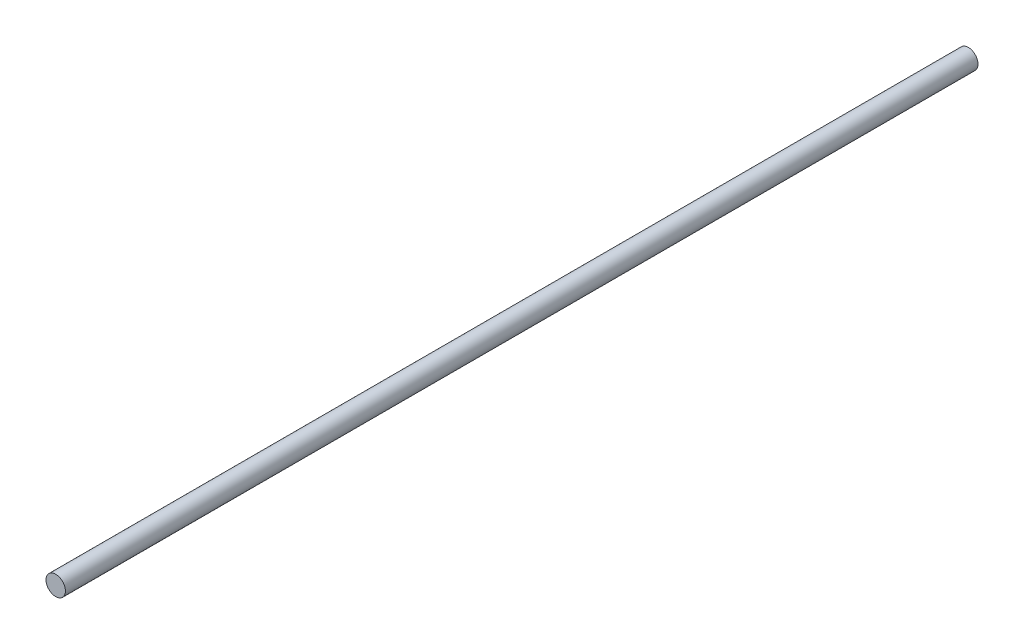
ISO-10303-21;
HEADER;
FILE_DESCRIPTION(('STEP AP214'),'2;1');
FILE_NAME('part.step','',(''),(''),'','','');
FILE_SCHEMA(('AUTOMOTIVE_DESIGN { 1 0 10303 214 1 1 1 1 }'));
ENDSEC;
DATA;
#1=APPLICATION_CONTEXT('core data for automotive mechanical design processes');
#2=APPLICATION_PROTOCOL_DEFINITION('international standard','automotive_design',2000,#1);
#3=PRODUCT_CONTEXT('',#1,'mechanical');
#4=PRODUCT('Part','Part','',(#3));
#5=PRODUCT_RELATED_PRODUCT_CATEGORY('part','',(#4));
#6=PRODUCT_DEFINITION_FORMATION('','',#4);
#7=PRODUCT_DEFINITION_CONTEXT('part definition',#1,'design');
#8=PRODUCT_DEFINITION('design','',#6,#7);
#9=PRODUCT_DEFINITION_SHAPE('','',#8);
#10=(LENGTH_UNIT() NAMED_UNIT(*) SI_UNIT(.MILLI.,.METRE.));
#11=(NAMED_UNIT(*) PLANE_ANGLE_UNIT() SI_UNIT($,.RADIAN.));
#12=(NAMED_UNIT(*) SI_UNIT($,.STERADIAN.) SOLID_ANGLE_UNIT());
#13=UNCERTAINTY_MEASURE_WITH_UNIT(LENGTH_MEASURE(1.E-05),#10,'distance_accuracy_value','');
#14=(GEOMETRIC_REPRESENTATION_CONTEXT(3) GLOBAL_UNCERTAINTY_ASSIGNED_CONTEXT((#13)) GLOBAL_UNIT_ASSIGNED_CONTEXT((#10,
#11,#12)) REPRESENTATION_CONTEXT('',''));
#15=CARTESIAN_POINT('',(0.,0.,0.));
#16=DIRECTION('',(0.,0.,1.));
#17=DIRECTION('',(1.,0.,0.));
#18=AXIS2_PLACEMENT_3D('',#15,#16,#17);
#19=CARTESIAN_POINT('',(0.,0.,-12.1484030110657));
#20=DIRECTION('',(0.,0.,1.));
#21=DIRECTION('',(1.,0.,0.));
#22=AXIS2_PLACEMENT_3D('',#19,#20,#21);
#23=PLANE('',#22);
#24=CARTESIAN_POINT('',(0.,0.,-12.1484030110657));
#25=DIRECTION('',(0.,0.,-1.));
#26=DIRECTION('',(-1.,0.,0.));
#27=AXIS2_PLACEMENT_3D('',#24,#25,#26);
#28=CIRCLE('',#27,4.);
#29=CARTESIAN_POINT('',(-4.,0.,-12.1484030110657));
#30=VERTEX_POINT('',#29);
#31=EDGE_CURVE('E10',#30,#30,#28,.T.);
#32=ORIENTED_EDGE('',*,*,#31,.F.);
#33=EDGE_LOOP('',(#32));
#34=FACE_BOUND('',#33,.T.);
#35=ADVANCED_FACE('F32',(#34),#23,.T.);
#36=CARTESIAN_POINT('',(0.,0.,-12.1484030110657));
#37=DIRECTION('',(0.,0.,-1.));
#38=DIRECTION('',(-1.,0.,0.));
#39=AXIS2_PLACEMENT_3D('',#36,#37,#38);
#40=CYLINDRICAL_SURFACE('',#39,4.);
#41=ORIENTED_EDGE('',*,*,#31,.T.);
#42=EDGE_LOOP('',(#41));
#43=FACE_BOUND('',#42,.T.);
#44=CARTESIAN_POINT('',(0.,0.,-387.851596988934));
#45=DIRECTION('',(0.,0.,-1.));
#46=DIRECTION('',(-1.,0.,0.));
#47=AXIS2_PLACEMENT_3D('',#44,#45,#46);
#48=CIRCLE('',#47,4.);
#49=CARTESIAN_POINT('',(-4.,0.,-387.851596988934));
#50=VERTEX_POINT('',#49);
#51=EDGE_CURVE('E38',#50,#50,#48,.T.);
#52=ORIENTED_EDGE('',*,*,#51,.F.);
#53=EDGE_LOOP('',(#52));
#54=FACE_BOUND('',#53,.T.);
#55=ADVANCED_FACE('F46',(#43,#54),#40,.T.);
#56=CARTESIAN_POINT('',(0.,0.,-387.851596988934));
#57=DIRECTION('',(0.,0.,-1.));
#58=DIRECTION('',(-1.,0.,0.));
#59=AXIS2_PLACEMENT_3D('',#56,#57,#58);
#60=PLANE('',#59);
#61=ORIENTED_EDGE('',*,*,#51,.T.);
#62=EDGE_LOOP('',(#61));
#63=FACE_BOUND('',#62,.T.);
#64=ADVANCED_FACE('F44',(#63),#60,.T.);
#65=CLOSED_SHELL('',(#35,#55,#64));
#66=MANIFOLD_SOLID_BREP('B2',#65);
#67=ADVANCED_BREP_SHAPE_REPRESENTATION('',(#18,#66),#14);
#68=SHAPE_DEFINITION_REPRESENTATION(#9,#67);
ENDSEC;
END-ISO-10303-21;
